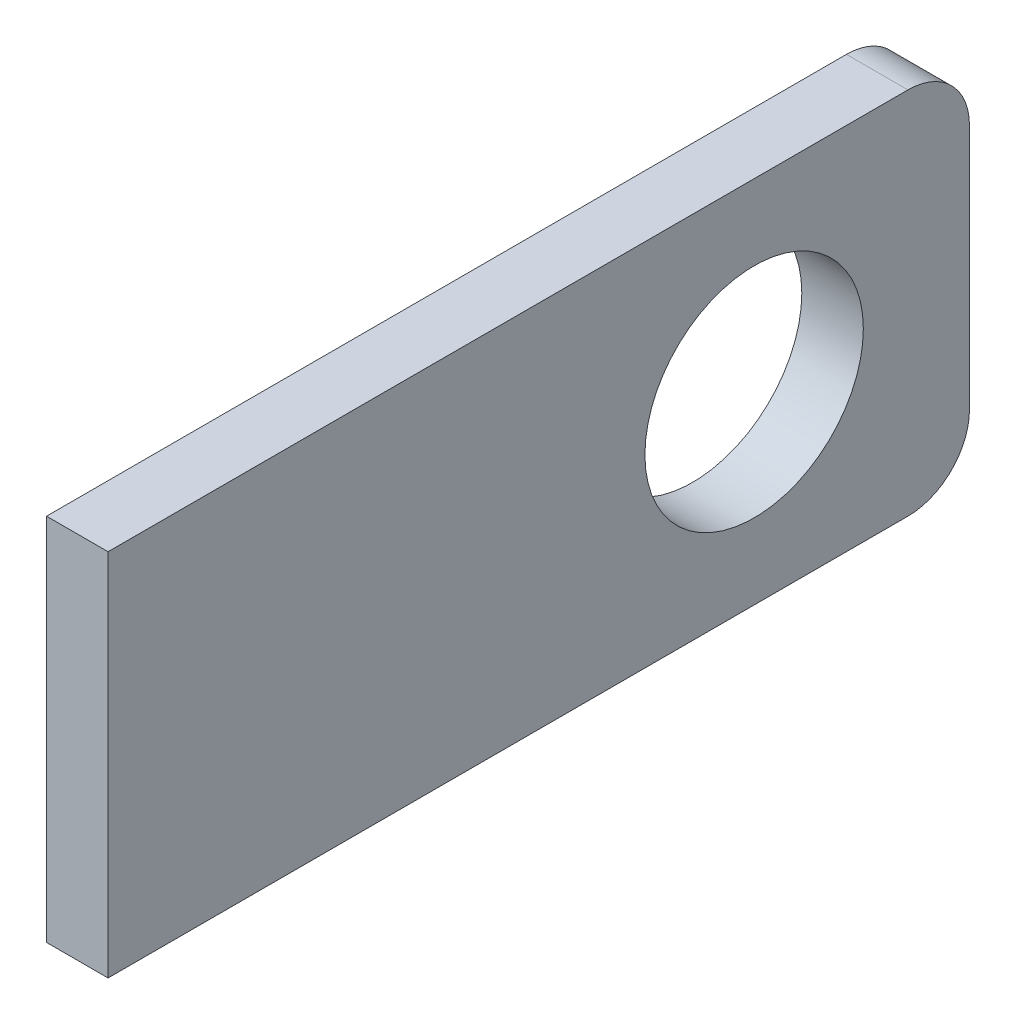
ISO-10303-21;
HEADER;
FILE_DESCRIPTION(('STEP AP214'),'2;1');
FILE_NAME('part.step','',(''),(''),'','','');
FILE_SCHEMA(('AUTOMOTIVE_DESIGN { 1 0 10303 214 1 1 1 1 }'));
ENDSEC;
DATA;
#1=APPLICATION_CONTEXT('core data for automotive mechanical design processes');
#2=APPLICATION_PROTOCOL_DEFINITION('international standard','automotive_design',2000,#1);
#3=PRODUCT_CONTEXT('',#1,'mechanical');
#4=PRODUCT('Part','Part','',(#3));
#5=PRODUCT_RELATED_PRODUCT_CATEGORY('part','',(#4));
#6=PRODUCT_DEFINITION_FORMATION('','',#4);
#7=PRODUCT_DEFINITION_CONTEXT('part definition',#1,'design');
#8=PRODUCT_DEFINITION('design','',#6,#7);
#9=PRODUCT_DEFINITION_SHAPE('','',#8);
#10=(LENGTH_UNIT() NAMED_UNIT(*) SI_UNIT(.MILLI.,.METRE.));
#11=(NAMED_UNIT(*) PLANE_ANGLE_UNIT() SI_UNIT($,.RADIAN.));
#12=(NAMED_UNIT(*) SI_UNIT($,.STERADIAN.) SOLID_ANGLE_UNIT());
#13=UNCERTAINTY_MEASURE_WITH_UNIT(LENGTH_MEASURE(1.E-05),#10,'distance_accuracy_value','');
#14=(GEOMETRIC_REPRESENTATION_CONTEXT(3) GLOBAL_UNCERTAINTY_ASSIGNED_CONTEXT((#13)) GLOBAL_UNIT_ASSIGNED_CONTEXT((#10,
#11,#12)) REPRESENTATION_CONTEXT('',''));
#15=CARTESIAN_POINT('',(0.,0.,0.));
#16=DIRECTION('',(0.,0.,1.));
#17=DIRECTION('',(1.,0.,0.));
#18=AXIS2_PLACEMENT_3D('',#15,#16,#17);
#19=CARTESIAN_POINT('',(-49.9999999999996,-60.0000000000011,-585.));
#20=DIRECTION('',(1.,0.,0.));
#21=DIRECTION('',(0.,0.,-0.999999999999999));
#22=AXIS2_PLACEMENT_3D('',#19,#20,#21);
#23=PLANE('',#22);
#24=CARTESIAN_POINT('',(-49.9999999999997,-30.0000000000005,-550.000000000001));
#25=DIRECTION('',(1.,0.,0.));
#26=DIRECTION('',(0.,0.,-0.999999999999999));
#27=AXIS2_PLACEMENT_3D('',#24,#25,#26);
#28=CIRCLE('',#27,17.7500000000001);
#29=CARTESIAN_POINT('',(-49.9999999999997,-30.0000000000005,-567.750000000001));
#30=VERTEX_POINT('',#29);
#31=EDGE_CURVE('E128',#30,#30,#28,.F.);
#32=ORIENTED_EDGE('',*,*,#31,.F.);
#33=EDGE_LOOP('',(#32));
#34=FACE_BOUND('',#33,.T.);
#35=DIRECTION('',(0.,0.,0.999999999999999));
#36=VECTOR('',#35,1.);
#37=CARTESIAN_POINT('',(-49.9999999999997,0.,-585.));
#38=LINE('',#37,#36);
#39=CARTESIAN_POINT('',(-49.9999999999998,-6.66133814775094E-13,-575.));
#40=VERTEX_POINT('',#39);
#41=CARTESIAN_POINT('',(-49.9999999999997,0.,-445.));
#42=VERTEX_POINT('',#41);
#43=EDGE_CURVE('E140',#40,#42,#38,.T.);
#44=ORIENTED_EDGE('',*,*,#43,.F.);
#45=CARTESIAN_POINT('',(-49.9999999999998,-10.,-575.));
#46=DIRECTION('',(1.,0.,0.));
#47=DIRECTION('',(0.,0.,-0.999999999999999));
#48=AXIS2_PLACEMENT_3D('',#45,#46,#47);
#49=CIRCLE('',#48,10.);
#50=CARTESIAN_POINT('',(-49.9999999999996,-10.,-585.));
#51=VERTEX_POINT('',#50);
#52=EDGE_CURVE('E148',#40,#51,#49,.F.);
#53=ORIENTED_EDGE('',*,*,#52,.T.);
#54=DIRECTION('',(0.,0.999999999999999,0.));
#55=VECTOR('',#54,1.);
#56=CARTESIAN_POINT('',(-49.9999999999996,-60.0000000000011,-585.));
#57=LINE('',#56,#55);
#58=CARTESIAN_POINT('',(-49.9999999999997,-50.0000000000017,-585.));
#59=VERTEX_POINT('',#58);
#60=EDGE_CURVE('E112',#59,#51,#57,.T.);
#61=ORIENTED_EDGE('',*,*,#60,.F.);
#62=CARTESIAN_POINT('',(-49.9999999999997,-50.000000000001,-575.));
#63=DIRECTION('',(1.,0.,0.));
#64=DIRECTION('',(0.,0.,-0.999999999999999));
#65=AXIS2_PLACEMENT_3D('',#62,#63,#64);
#66=CIRCLE('',#65,10.);
#67=CARTESIAN_POINT('',(-49.9999999999998,-60.0000000000017,-575.));
#68=VERTEX_POINT('',#67);
#69=EDGE_CURVE('E63',#59,#68,#66,.F.);
#70=ORIENTED_EDGE('',*,*,#69,.T.);
#71=DIRECTION('',(0.,0.,0.999999999999999));
#72=VECTOR('',#71,1.);
#73=CARTESIAN_POINT('',(-49.9999999999996,-60.0000000000011,-585.));
#74=LINE('',#73,#72);
#75=CARTESIAN_POINT('',(-49.9999999999997,-60.0000000000011,-445.));
#76=VERTEX_POINT('',#75);
#77=EDGE_CURVE('E99',#68,#76,#74,.T.);
#78=ORIENTED_EDGE('',*,*,#77,.T.);
#79=DIRECTION('',(0.,0.999999999999999,0.));
#80=VECTOR('',#79,1.);
#81=CARTESIAN_POINT('',(-49.9999999999997,-60.0000000000011,-445.));
#82=LINE('',#81,#80);
#83=EDGE_CURVE('E127',#76,#42,#82,.T.);
#84=ORIENTED_EDGE('',*,*,#83,.T.);
#85=EDGE_LOOP('',(#44,#53,#61,#70,#78,#84));
#86=FACE_BOUND('',#85,.T.);
#87=ADVANCED_FACE('F40',(#34,#86),#23,.F.);
#88=CARTESIAN_POINT('',(-39.9999999999997,-1.11022302462516E-13,-585.));
#89=DIRECTION('',(0.,-0.999999999999999,0.));
#90=DIRECTION('',(0.,0.,-0.999999999999999));
#91=AXIS2_PLACEMENT_3D('',#88,#89,#90);
#92=PLANE('',#91);
#93=DIRECTION('',(-1.,0.,0.));
#94=VECTOR('',#93,1.);
#95=CARTESIAN_POINT('',(610.000000000001,0.,-575.000000000001));
#96=LINE('',#95,#94);
#97=CARTESIAN_POINT('',(-39.9999999999997,-6.66133814775094E-13,-575.));
#98=VERTEX_POINT('',#97);
#99=EDGE_CURVE('E108',#98,#40,#96,.T.);
#100=ORIENTED_EDGE('',*,*,#99,.T.);
#101=ORIENTED_EDGE('',*,*,#43,.T.);
#102=DIRECTION('',(1.,0.,0.));
#103=VECTOR('',#102,1.);
#104=CARTESIAN_POINT('',(-39.9999999999997,0.,-445.));
#105=LINE('',#104,#103);
#106=CARTESIAN_POINT('',(-39.9999999999997,0.,-445.));
#107=VERTEX_POINT('',#106);
#108=EDGE_CURVE('E132',#42,#107,#105,.T.);
#109=ORIENTED_EDGE('',*,*,#108,.T.);
#110=DIRECTION('',(0.,0.,0.999999999999999));
#111=VECTOR('',#110,1.);
#112=CARTESIAN_POINT('',(-39.9999999999997,-1.11022302462516E-13,-585.));
#113=LINE('',#112,#111);
#114=EDGE_CURVE('E116',#98,#107,#113,.T.);
#115=ORIENTED_EDGE('',*,*,#114,.F.);
#116=EDGE_LOOP('',(#100,#101,#109,#115));
#117=FACE_BOUND('',#116,.T.);
#118=ADVANCED_FACE('F173',(#117),#92,.F.);
#119=CARTESIAN_POINT('',(-39.9999999999997,-60.0000000000012,-585.));
#120=DIRECTION('',(-1.,0.,0.));
#121=DIRECTION('',(0.,0.,0.999999999999999));
#122=AXIS2_PLACEMENT_3D('',#119,#120,#121);
#123=PLANE('',#122);
#124=CARTESIAN_POINT('',(-39.9999999999997,-30.0000000000007,-550.));
#125=DIRECTION('',(-1.,0.,0.));
#126=DIRECTION('',(0.,0.,0.999999999999999));
#127=AXIS2_PLACEMENT_3D('',#124,#125,#126);
#128=CIRCLE('',#127,17.7500000000001);
#129=CARTESIAN_POINT('',(-39.9999999999997,-30.0000000000007,-532.25));
#130=VERTEX_POINT('',#129);
#131=EDGE_CURVE('E145',#130,#130,#128,.F.);
#132=ORIENTED_EDGE('',*,*,#131,.F.);
#133=EDGE_LOOP('',(#132));
#134=FACE_BOUND('',#133,.T.);
#135=DIRECTION('',(0.,-0.999999999999999,0.));
#136=VECTOR('',#135,1.);
#137=CARTESIAN_POINT('',(-39.9999999999997,-60.0000000000012,-585.));
#138=LINE('',#137,#136);
#139=CARTESIAN_POINT('',(-39.9999999999997,-10.0000000000001,-585.));
#140=VERTEX_POINT('',#139);
#141=CARTESIAN_POINT('',(-39.9999999999997,-50.0000000000017,-585.));
#142=VERTEX_POINT('',#141);
#143=EDGE_CURVE('E104',#140,#142,#138,.T.);
#144=ORIENTED_EDGE('',*,*,#143,.F.);
#145=CARTESIAN_POINT('',(-39.9999999999997,-10.,-575.));
#146=DIRECTION('',(-1.,0.,0.));
#147=DIRECTION('',(0.,0.,0.999999999999999));
#148=AXIS2_PLACEMENT_3D('',#145,#146,#147);
#149=CIRCLE('',#148,10.);
#150=EDGE_CURVE('E56',#140,#98,#149,.F.);
#151=ORIENTED_EDGE('',*,*,#150,.T.);
#152=ORIENTED_EDGE('',*,*,#114,.T.);
#153=DIRECTION('',(0.,-0.999999999999999,0.));
#154=VECTOR('',#153,1.);
#155=CARTESIAN_POINT('',(-39.9999999999996,-60.0000000000011,-445.));
#156=LINE('',#155,#154);
#157=CARTESIAN_POINT('',(-39.9999999999996,-60.0000000000011,-445.));
#158=VERTEX_POINT('',#157);
#159=EDGE_CURVE('E119',#107,#158,#156,.T.);
#160=ORIENTED_EDGE('',*,*,#159,.T.);
#161=DIRECTION('',(0.,0.,0.999999999999999));
#162=VECTOR('',#161,1.);
#163=CARTESIAN_POINT('',(-39.9999999999997,-60.0000000000012,-585.));
#164=LINE('',#163,#162);
#165=CARTESIAN_POINT('',(-39.9999999999997,-60.0000000000017,-575.));
#166=VERTEX_POINT('',#165);
#167=EDGE_CURVE('E106',#166,#158,#164,.T.);
#168=ORIENTED_EDGE('',*,*,#167,.F.);
#169=CARTESIAN_POINT('',(-39.9999999999997,-50.000000000001,-575.));
#170=DIRECTION('',(-1.,0.,0.));
#171=DIRECTION('',(0.,0.,0.999999999999999));
#172=AXIS2_PLACEMENT_3D('',#169,#170,#171);
#173=CIRCLE('',#172,10.);
#174=EDGE_CURVE('E92',#166,#142,#173,.F.);
#175=ORIENTED_EDGE('',*,*,#174,.T.);
#176=EDGE_LOOP('',(#144,#151,#152,#160,#168,#175));
#177=FACE_BOUND('',#176,.T.);
#178=ADVANCED_FACE('F103',(#134,#177),#123,.F.);
#179=CARTESIAN_POINT('',(-5.,-30.0000000000011,-584.999999999999));
#180=DIRECTION('',(0.,0.,0.999999999999999));
#181=DIRECTION('',(1.,0.,0.));
#182=AXIS2_PLACEMENT_3D('',#179,#180,#181);
#183=PLANE('',#182);
#184=ORIENTED_EDGE('',*,*,#60,.T.);
#185=DIRECTION('',(-1.,0.,0.));
#186=VECTOR('',#185,1.);
#187=CARTESIAN_POINT('',(610.000000000001,-10.,-585.000000000001));
#188=LINE('',#187,#186);
#189=EDGE_CURVE('E11',#51,#140,#188,.F.);
#190=ORIENTED_EDGE('',*,*,#189,.T.);
#191=ORIENTED_EDGE('',*,*,#143,.T.);
#192=DIRECTION('',(-1.,0.,0.));
#193=VECTOR('',#192,1.);
#194=CARTESIAN_POINT('',(610.000000000001,-50.0000000000016,-585.000000000001));
#195=LINE('',#194,#193);
#196=EDGE_CURVE('E49',#59,#142,#195,.F.);
#197=ORIENTED_EDGE('',*,*,#196,.F.);
#198=EDGE_LOOP('',(#184,#190,#191,#197));
#199=FACE_BOUND('',#198,.T.);
#200=ADVANCED_FACE('F110',(#199),#183,.F.);
#201=CARTESIAN_POINT('',(-49.9999999999996,-60.0000000000011,-585.));
#202=DIRECTION('',(0.,0.999999999999999,0.));
#203=DIRECTION('',(0.,0.,0.999999999999999));
#204=AXIS2_PLACEMENT_3D('',#201,#202,#203);
#205=PLANE('',#204);
#206=ORIENTED_EDGE('',*,*,#77,.F.);
#207=DIRECTION('',(-1.,0.,0.));
#208=VECTOR('',#207,1.);
#209=CARTESIAN_POINT('',(610.000000000001,-60.0000000000011,-575.000000000001));
#210=LINE('',#209,#208);
#211=EDGE_CURVE('E165',#166,#68,#210,.T.);
#212=ORIENTED_EDGE('',*,*,#211,.F.);
#213=ORIENTED_EDGE('',*,*,#167,.T.);
#214=DIRECTION('',(-1.,0.,0.));
#215=VECTOR('',#214,1.);
#216=CARTESIAN_POINT('',(-49.9999999999997,-60.0000000000011,-445.));
#217=LINE('',#216,#215);
#218=EDGE_CURVE('E123',#158,#76,#217,.T.);
#219=ORIENTED_EDGE('',*,*,#218,.T.);
#220=EDGE_LOOP('',(#206,#212,#213,#219));
#221=FACE_BOUND('',#220,.T.);
#222=ADVANCED_FACE('F42',(#221),#205,.F.);
#223=CARTESIAN_POINT('',(-5.00000000000003,-30.0000000000011,-445.));
#224=DIRECTION('',(0.,0.,0.999999999999999));
#225=DIRECTION('',(1.,0.,0.));
#226=AXIS2_PLACEMENT_3D('',#223,#224,#225);
#227=PLANE('',#226);
#228=ORIENTED_EDGE('',*,*,#218,.F.);
#229=ORIENTED_EDGE('',*,*,#159,.F.);
#230=ORIENTED_EDGE('',*,*,#108,.F.);
#231=ORIENTED_EDGE('',*,*,#83,.F.);
#232=EDGE_LOOP('',(#228,#229,#230,#231));
#233=FACE_BOUND('',#232,.T.);
#234=ADVANCED_FACE('F180',(#233),#227,.T.);
#235=CARTESIAN_POINT('',(610.000000000002,-30.0000000000004,-550.));
#236=DIRECTION('',(-1.,0.,0.));
#237=DIRECTION('',(0.,0.,1.));
#238=AXIS2_PLACEMENT_3D('',#235,#236,#237);
#239=CYLINDRICAL_SURFACE('',#238,17.7500000000001);
#240=ORIENTED_EDGE('',*,*,#131,.T.);
#241=EDGE_LOOP('',(#240));
#242=FACE_BOUND('',#241,.T.);
#243=ORIENTED_EDGE('',*,*,#31,.T.);
#244=EDGE_LOOP('',(#243));
#245=FACE_BOUND('',#244,.T.);
#246=ADVANCED_FACE('F187',(#242,#245),#239,.F.);
#247=CARTESIAN_POINT('',(610.000000000001,-50.000000000001,-575.000000000001));
#248=DIRECTION('',(-1.,0.,0.));
#249=DIRECTION('',(0.,0.,1.));
#250=AXIS2_PLACEMENT_3D('',#247,#248,#249);
#251=CYLINDRICAL_SURFACE('',#250,10.);
#252=ORIENTED_EDGE('',*,*,#196,.T.);
#253=ORIENTED_EDGE('',*,*,#174,.F.);
#254=ORIENTED_EDGE('',*,*,#211,.T.);
#255=ORIENTED_EDGE('',*,*,#69,.F.);
#256=EDGE_LOOP('',(#252,#253,#254,#255));
#257=FACE_BOUND('',#256,.T.);
#258=ADVANCED_FACE('F91',(#257),#251,.T.);
#259=CARTESIAN_POINT('',(610.000000000002,-10.,-575.));
#260=DIRECTION('',(-1.,0.,0.));
#261=DIRECTION('',(0.,0.,1.));
#262=AXIS2_PLACEMENT_3D('',#259,#260,#261);
#263=CYLINDRICAL_SURFACE('',#262,10.);
#264=ORIENTED_EDGE('',*,*,#99,.F.);
#265=ORIENTED_EDGE('',*,*,#150,.F.);
#266=ORIENTED_EDGE('',*,*,#189,.F.);
#267=ORIENTED_EDGE('',*,*,#52,.F.);
#268=EDGE_LOOP('',(#264,#265,#266,#267));
#269=FACE_BOUND('',#268,.T.);
#270=ADVANCED_FACE('F205',(#269),#263,.T.);
#271=CLOSED_SHELL('',(#87,#118,#178,#200,#222,#234,#246,#258,#270));
#272=MANIFOLD_SOLID_BREP('B2',#271);
#273=ADVANCED_BREP_SHAPE_REPRESENTATION('',(#18,#272),#14);
#274=SHAPE_DEFINITION_REPRESENTATION(#9,#273);
ENDSEC;
END-ISO-10303-21;
